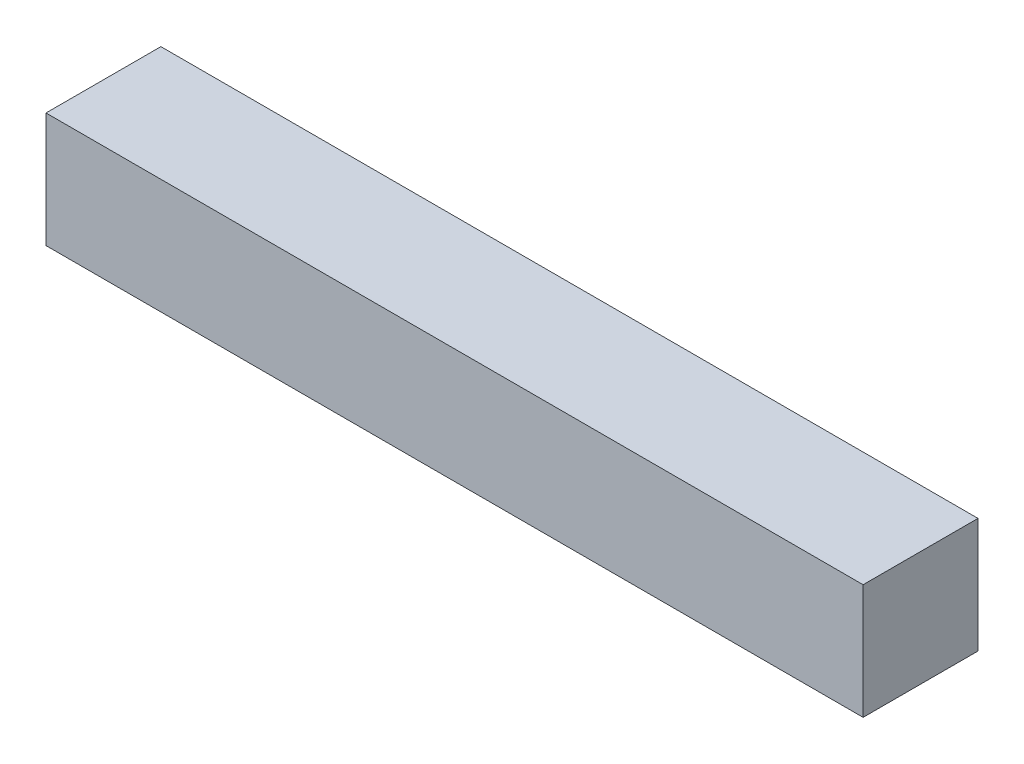
ISO-10303-21;
HEADER;
FILE_DESCRIPTION(('STEP AP214'),'2;1');
FILE_NAME('part.step','',(''),(''),'','','');
FILE_SCHEMA(('AUTOMOTIVE_DESIGN { 1 0 10303 214 1 1 1 1 }'));
ENDSEC;
DATA;
#1=APPLICATION_CONTEXT('core data for automotive mechanical design processes');
#2=APPLICATION_PROTOCOL_DEFINITION('international standard','automotive_design',2000,#1);
#3=PRODUCT_CONTEXT('',#1,'mechanical');
#4=PRODUCT('Part','Part','',(#3));
#5=PRODUCT_RELATED_PRODUCT_CATEGORY('part','',(#4));
#6=PRODUCT_DEFINITION_FORMATION('','',#4);
#7=PRODUCT_DEFINITION_CONTEXT('part definition',#1,'design');
#8=PRODUCT_DEFINITION('design','',#6,#7);
#9=PRODUCT_DEFINITION_SHAPE('','',#8);
#10=(LENGTH_UNIT() NAMED_UNIT(*) SI_UNIT(.MILLI.,.METRE.));
#11=(NAMED_UNIT(*) PLANE_ANGLE_UNIT() SI_UNIT($,.RADIAN.));
#12=(NAMED_UNIT(*) SI_UNIT($,.STERADIAN.) SOLID_ANGLE_UNIT());
#13=UNCERTAINTY_MEASURE_WITH_UNIT(LENGTH_MEASURE(1.E-05),#10,'distance_accuracy_value','');
#14=(GEOMETRIC_REPRESENTATION_CONTEXT(3) GLOBAL_UNCERTAINTY_ASSIGNED_CONTEXT((#13)) GLOBAL_UNIT_ASSIGNED_CONTEXT((#10,
#11,#12)) REPRESENTATION_CONTEXT('',''));
#15=CARTESIAN_POINT('',(0.,0.,0.));
#16=DIRECTION('',(0.,0.,1.));
#17=DIRECTION('',(1.,0.,0.));
#18=AXIS2_PLACEMENT_3D('',#15,#16,#17);
#19=CARTESIAN_POINT('',(-12.7,215.5,25.));
#20=DIRECTION('',(-1.,0.,0.));
#21=DIRECTION('',(0.,0.,1.));
#22=AXIS2_PLACEMENT_3D('',#19,#20,#21);
#23=PLANE('',#22);
#24=DIRECTION('',(0.,1.,0.));
#25=VECTOR('',#24,1.);
#26=CARTESIAN_POINT('',(-12.7,215.5,0.));
#27=LINE('',#26,#25);
#28=CARTESIAN_POINT('',(-12.7,190.5,0.));
#29=VERTEX_POINT('',#28);
#30=CARTESIAN_POINT('',(-12.7,215.5,0.));
#31=VERTEX_POINT('',#30);
#32=EDGE_CURVE('E98',#29,#31,#27,.T.);
#33=ORIENTED_EDGE('',*,*,#32,.T.);
#34=DIRECTION('',(0.,0.,-1.));
#35=VECTOR('',#34,1.);
#36=CARTESIAN_POINT('',(-12.7,215.5,25.));
#37=LINE('',#36,#35);
#38=CARTESIAN_POINT('',(-12.7,215.5,25.));
#39=VERTEX_POINT('',#38);
#40=EDGE_CURVE('E11',#39,#31,#37,.T.);
#41=ORIENTED_EDGE('',*,*,#40,.F.);
#42=DIRECTION('',(0.,1.,0.));
#43=VECTOR('',#42,1.);
#44=CARTESIAN_POINT('',(-12.7,215.5,25.));
#45=LINE('',#44,#43);
#46=CARTESIAN_POINT('',(-12.7,190.5,25.));
#47=VERTEX_POINT('',#46);
#48=EDGE_CURVE('E86',#47,#39,#45,.T.);
#49=ORIENTED_EDGE('',*,*,#48,.F.);
#50=DIRECTION('',(0.,0.,-1.));
#51=VECTOR('',#50,1.);
#52=CARTESIAN_POINT('',(-12.7,190.5,25.));
#53=LINE('',#52,#51);
#54=EDGE_CURVE('E94',#47,#29,#53,.T.);
#55=ORIENTED_EDGE('',*,*,#54,.T.);
#56=EDGE_LOOP('',(#33,#41,#49,#55));
#57=FACE_BOUND('',#56,.T.);
#58=ADVANCED_FACE('F35',(#57),#23,.F.);
#59=CARTESIAN_POINT('',(-12.7,215.5,25.));
#60=DIRECTION('',(0.,-1.,0.));
#61=DIRECTION('',(0.,0.,-1.));
#62=AXIS2_PLACEMENT_3D('',#59,#60,#61);
#63=PLANE('',#62);
#64=DIRECTION('',(-1.,0.,0.));
#65=VECTOR('',#64,1.);
#66=CARTESIAN_POINT('',(-12.7,215.5,0.));
#67=LINE('',#66,#65);
#68=CARTESIAN_POINT('',(-190.5,215.5,0.));
#69=VERTEX_POINT('',#68);
#70=EDGE_CURVE('E90',#31,#69,#67,.T.);
#71=ORIENTED_EDGE('',*,*,#70,.T.);
#72=DIRECTION('',(0.,0.,-1.));
#73=VECTOR('',#72,1.);
#74=CARTESIAN_POINT('',(-190.5,215.5,25.));
#75=LINE('',#74,#73);
#76=CARTESIAN_POINT('',(-190.5,215.5,25.));
#77=VERTEX_POINT('',#76);
#78=EDGE_CURVE('E43',#77,#69,#75,.T.);
#79=ORIENTED_EDGE('',*,*,#78,.F.);
#80=DIRECTION('',(-1.,0.,0.));
#81=VECTOR('',#80,1.);
#82=CARTESIAN_POINT('',(-12.7,215.5,25.));
#83=LINE('',#82,#81);
#84=EDGE_CURVE('E81',#39,#77,#83,.T.);
#85=ORIENTED_EDGE('',*,*,#84,.F.);
#86=ORIENTED_EDGE('',*,*,#40,.T.);
#87=EDGE_LOOP('',(#71,#79,#85,#86));
#88=FACE_BOUND('',#87,.T.);
#89=ADVANCED_FACE('F89',(#88),#63,.F.);
#90=CARTESIAN_POINT('',(-190.5,215.5,25.));
#91=DIRECTION('',(1.,0.,0.));
#92=DIRECTION('',(0.,0.,-1.));
#93=AXIS2_PLACEMENT_3D('',#90,#91,#92);
#94=PLANE('',#93);
#95=DIRECTION('',(0.,-1.,0.));
#96=VECTOR('',#95,1.);
#97=CARTESIAN_POINT('',(-190.5,215.5,0.));
#98=LINE('',#97,#96);
#99=CARTESIAN_POINT('',(-190.5,190.5,0.));
#100=VERTEX_POINT('',#99);
#101=EDGE_CURVE('E68',#69,#100,#98,.T.);
#102=ORIENTED_EDGE('',*,*,#101,.T.);
#103=DIRECTION('',(0.,0.,-1.));
#104=VECTOR('',#103,1.);
#105=CARTESIAN_POINT('',(-190.5,190.5,25.));
#106=LINE('',#105,#104);
#107=CARTESIAN_POINT('',(-190.5,190.5,25.));
#108=VERTEX_POINT('',#107);
#109=EDGE_CURVE('E91',#108,#100,#106,.T.);
#110=ORIENTED_EDGE('',*,*,#109,.F.);
#111=DIRECTION('',(0.,-1.,0.));
#112=VECTOR('',#111,1.);
#113=CARTESIAN_POINT('',(-190.5,215.5,25.));
#114=LINE('',#113,#112);
#115=EDGE_CURVE('E84',#77,#108,#114,.T.);
#116=ORIENTED_EDGE('',*,*,#115,.F.);
#117=ORIENTED_EDGE('',*,*,#78,.T.);
#118=EDGE_LOOP('',(#102,#110,#116,#117));
#119=FACE_BOUND('',#118,.T.);
#120=ADVANCED_FACE('F92',(#119),#94,.F.);
#121=CARTESIAN_POINT('',(-12.7,190.5,25.));
#122=DIRECTION('',(0.,1.,0.));
#123=DIRECTION('',(0.,0.,1.));
#124=AXIS2_PLACEMENT_3D('',#121,#122,#123);
#125=PLANE('',#124);
#126=DIRECTION('',(1.,0.,0.));
#127=VECTOR('',#126,1.);
#128=CARTESIAN_POINT('',(-12.7,190.5,0.));
#129=LINE('',#128,#127);
#130=EDGE_CURVE('E74',#100,#29,#129,.T.);
#131=ORIENTED_EDGE('',*,*,#130,.T.);
#132=ORIENTED_EDGE('',*,*,#54,.F.);
#133=DIRECTION('',(1.,0.,0.));
#134=VECTOR('',#133,1.);
#135=CARTESIAN_POINT('',(-12.7,190.5,25.));
#136=LINE('',#135,#134);
#137=EDGE_CURVE('E51',#108,#47,#136,.T.);
#138=ORIENTED_EDGE('',*,*,#137,.F.);
#139=ORIENTED_EDGE('',*,*,#109,.T.);
#140=EDGE_LOOP('',(#131,#132,#138,#139));
#141=FACE_BOUND('',#140,.T.);
#142=ADVANCED_FACE('F105',(#141),#125,.F.);
#143=CARTESIAN_POINT('',(-12.7,190.5,25.));
#144=DIRECTION('',(0.,0.,-1.));
#145=DIRECTION('',(-1.,0.,0.));
#146=AXIS2_PLACEMENT_3D('',#143,#144,#145);
#147=PLANE('',#146);
#148=ORIENTED_EDGE('',*,*,#48,.T.);
#149=ORIENTED_EDGE('',*,*,#84,.T.);
#150=ORIENTED_EDGE('',*,*,#115,.T.);
#151=ORIENTED_EDGE('',*,*,#137,.T.);
#152=EDGE_LOOP('',(#148,#149,#150,#151));
#153=FACE_BOUND('',#152,.T.);
#154=ADVANCED_FACE('F82',(#153),#147,.F.);
#155=CARTESIAN_POINT('',(-12.7,190.5,0.));
#156=DIRECTION('',(0.,0.,-1.));
#157=DIRECTION('',(-1.,0.,0.));
#158=AXIS2_PLACEMENT_3D('',#155,#156,#157);
#159=PLANE('',#158);
#160=ORIENTED_EDGE('',*,*,#32,.F.);
#161=ORIENTED_EDGE('',*,*,#130,.F.);
#162=ORIENTED_EDGE('',*,*,#101,.F.);
#163=ORIENTED_EDGE('',*,*,#70,.F.);
#164=EDGE_LOOP('',(#160,#161,#162,#163));
#165=FACE_BOUND('',#164,.T.);
#166=ADVANCED_FACE('F108',(#165),#159,.T.);
#167=CLOSED_SHELL('',(#58,#89,#120,#142,#154,#166));
#168=MANIFOLD_SOLID_BREP('B2',#167);
#169=ADVANCED_BREP_SHAPE_REPRESENTATION('',(#18,#168),#14);
#170=SHAPE_DEFINITION_REPRESENTATION(#9,#169);
ENDSEC;
END-ISO-10303-21;
